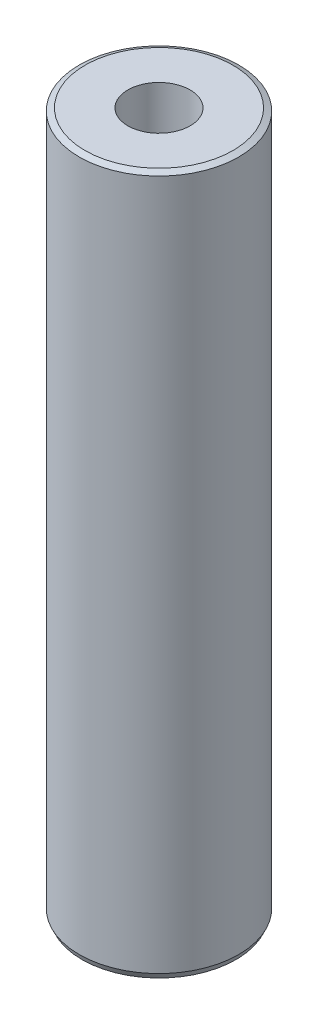
ISO-10303-21;
HEADER;
FILE_DESCRIPTION(('STEP AP214'),'2;1');
FILE_NAME('part.step','',(''),(''),'','','');
FILE_SCHEMA(('AUTOMOTIVE_DESIGN { 1 0 10303 214 1 1 1 1 }'));
ENDSEC;
DATA;
#1=APPLICATION_CONTEXT('core data for automotive mechanical design processes');
#2=APPLICATION_PROTOCOL_DEFINITION('international standard','automotive_design',2000,#1);
#3=PRODUCT_CONTEXT('',#1,'mechanical');
#4=PRODUCT('Part','Part','',(#3));
#5=PRODUCT_RELATED_PRODUCT_CATEGORY('part','',(#4));
#6=PRODUCT_DEFINITION_FORMATION('','',#4);
#7=PRODUCT_DEFINITION_CONTEXT('part definition',#1,'design');
#8=PRODUCT_DEFINITION('design','',#6,#7);
#9=PRODUCT_DEFINITION_SHAPE('','',#8);
#10=(LENGTH_UNIT() NAMED_UNIT(*) SI_UNIT(.MILLI.,.METRE.));
#11=(NAMED_UNIT(*) PLANE_ANGLE_UNIT() SI_UNIT($,.RADIAN.));
#12=(NAMED_UNIT(*) SI_UNIT($,.STERADIAN.) SOLID_ANGLE_UNIT());
#13=UNCERTAINTY_MEASURE_WITH_UNIT(LENGTH_MEASURE(1.E-05),#10,'distance_accuracy_value','');
#14=(GEOMETRIC_REPRESENTATION_CONTEXT(3) GLOBAL_UNCERTAINTY_ASSIGNED_CONTEXT((#13)) GLOBAL_UNIT_ASSIGNED_CONTEXT((#10,
#11,#12)) REPRESENTATION_CONTEXT('',''));
#15=CARTESIAN_POINT('',(0.,0.,0.));
#16=DIRECTION('',(0.,0.,1.));
#17=DIRECTION('',(1.,0.,0.));
#18=AXIS2_PLACEMENT_3D('',#15,#16,#17);
#19=CARTESIAN_POINT('',(0.,87.6766680087707,0.));
#20=DIRECTION('',(0.,-1.,0.));
#21=DIRECTION('',(0.,0.,-1.));
#22=AXIS2_PLACEMENT_3D('',#19,#20,#21);
#23=CYLINDRICAL_SURFACE('',#22,10.);
#24=CARTESIAN_POINT('',(0.,87.3367882755862,0.));
#25=DIRECTION('',(0.,1.,0.));
#26=DIRECTION('',(0.,0.,1.));
#27=AXIS2_PLACEMENT_3D('',#24,#25,#26);
#28=CIRCLE('',#27,10.);
#29=CARTESIAN_POINT('',(0.,87.3367882755862,10.));
#30=VERTEX_POINT('',#29);
#31=EDGE_CURVE('E50',#30,#30,#28,.F.);
#32=ORIENTED_EDGE('',*,*,#31,.T.);
#33=EDGE_LOOP('',(#32));
#34=FACE_BOUND('',#33,.T.);
#35=CARTESIAN_POINT('',(0.,0.723548102302532,0.));
#36=DIRECTION('',(0.,1.,0.));
#37=DIRECTION('',(0.,0.,1.));
#38=AXIS2_PLACEMENT_3D('',#35,#36,#37);
#39=CIRCLE('',#38,10.);
#40=CARTESIAN_POINT('',(0.,0.723548102302532,10.));
#41=VERTEX_POINT('',#40);
#42=EDGE_CURVE('E51',#41,#41,#39,.T.);
#43=ORIENTED_EDGE('',*,*,#42,.T.);
#44=EDGE_LOOP('',(#43));
#45=FACE_BOUND('',#44,.T.);
#46=ADVANCED_FACE('F39',(#34,#45),#23,.T.);
#47=CARTESIAN_POINT('',(0.,87.6766680087707,0.));
#48=DIRECTION('',(0.,1.,0.));
#49=DIRECTION('',(0.,0.,1.));
#50=AXIS2_PLACEMENT_3D('',#47,#48,#49);
#51=PLANE('',#50);
#52=CARTESIAN_POINT('',(0.,87.6766680087707,0.));
#53=DIRECTION('',(0.,1.,0.));
#54=DIRECTION('',(0.,0.,1.));
#55=AXIS2_PLACEMENT_3D('',#52,#53,#54);
#56=CIRCLE('',#55,9.27645189769753);
#57=CARTESIAN_POINT('',(0.,87.6766680087707,9.27645189769753));
#58=VERTEX_POINT('',#57);
#59=EDGE_CURVE('E54',#58,#58,#56,.T.);
#60=ORIENTED_EDGE('',*,*,#59,.T.);
#61=EDGE_LOOP('',(#60));
#62=FACE_BOUND('',#61,.T.);
#63=CARTESIAN_POINT('',(0.,87.6766680087707,0.));
#64=DIRECTION('',(0.,1.,0.));
#65=DIRECTION('',(0.,0.,1.));
#66=AXIS2_PLACEMENT_3D('',#63,#64,#65);
#67=CIRCLE('',#66,3.90674291616439);
#68=CARTESIAN_POINT('',(0.,87.6766680087707,3.90674291616439));
#69=VERTEX_POINT('',#68);
#70=EDGE_CURVE('E58',#69,#69,#67,.T.);
#71=ORIENTED_EDGE('',*,*,#70,.F.);
#72=EDGE_LOOP('',(#71));
#73=FACE_BOUND('',#72,.T.);
#74=ADVANCED_FACE('F69',(#62,#73),#51,.T.);
#75=CARTESIAN_POINT('',(0.,0.,0.));
#76=DIRECTION('',(0.,1.,0.));
#77=DIRECTION('',(0.,0.,1.));
#78=AXIS2_PLACEMENT_3D('',#75,#76,#77);
#79=PLANE('',#78);
#80=CARTESIAN_POINT('',(0.,0.,0.));
#81=DIRECTION('',(0.,1.,0.));
#82=DIRECTION('',(0.,0.,1.));
#83=AXIS2_PLACEMENT_3D('',#80,#81,#82);
#84=CIRCLE('',#83,9.66012026681551);
#85=CARTESIAN_POINT('',(0.,0.,9.66012026681551));
#86=VERTEX_POINT('',#85);
#87=EDGE_CURVE('E10',#86,#86,#84,.F.);
#88=ORIENTED_EDGE('',*,*,#87,.T.);
#89=EDGE_LOOP('',(#88));
#90=FACE_BOUND('',#89,.T.);
#91=CARTESIAN_POINT('',(0.,0.,0.));
#92=DIRECTION('',(0.,1.,0.));
#93=DIRECTION('',(0.,0.,1.));
#94=AXIS2_PLACEMENT_3D('',#91,#92,#93);
#95=CIRCLE('',#94,3.90674291616439);
#96=CARTESIAN_POINT('',(0.,0.,3.90674291616439));
#97=VERTEX_POINT('',#96);
#98=EDGE_CURVE('E63',#97,#97,#95,.T.);
#99=ORIENTED_EDGE('',*,*,#98,.T.);
#100=EDGE_LOOP('',(#99));
#101=FACE_BOUND('',#100,.T.);
#102=ADVANCED_FACE('F75',(#90,#101),#79,.F.);
#103=CARTESIAN_POINT('',(0.,87.6766680087707,0.));
#104=DIRECTION('',(0.,-1.,0.));
#105=DIRECTION('',(0.,0.,-1.));
#106=AXIS2_PLACEMENT_3D('',#103,#104,#105);
#107=CYLINDRICAL_SURFACE('',#106,3.90674291616439);
#108=ORIENTED_EDGE('',*,*,#70,.T.);
#109=EDGE_LOOP('',(#108));
#110=FACE_BOUND('',#109,.T.);
#111=ORIENTED_EDGE('',*,*,#98,.F.);
#112=EDGE_LOOP('',(#111));
#113=FACE_BOUND('',#112,.T.);
#114=ADVANCED_FACE('F70',(#110,#113),#107,.F.);
#115=CARTESIAN_POINT('',(0.,87.6766680087707,0.));
#116=DIRECTION('',(0.,-1.,0.));
#117=DIRECTION('',(0.,0.,-1.));
#118=AXIS2_PLACEMENT_3D('',#115,#116,#117);
#119=CONICAL_SURFACE('',#118,9.27645189769753,1.13164813812509);
#120=ORIENTED_EDGE('',*,*,#31,.F.);
#121=EDGE_LOOP('',(#120));
#122=FACE_BOUND('',#121,.T.);
#123=ORIENTED_EDGE('',*,*,#59,.F.);
#124=EDGE_LOOP('',(#123));
#125=FACE_BOUND('',#124,.T.);
#126=ADVANCED_FACE('F81',(#122,#125),#119,.T.);
#127=CARTESIAN_POINT('',(0.,0.723548102302532,0.));
#128=DIRECTION('',(0.,1.,0.));
#129=DIRECTION('',(0.,0.,1.));
#130=AXIS2_PLACEMENT_3D('',#127,#128,#129);
#131=CONICAL_SURFACE('',#130,10.,0.43914818866979);
#132=ORIENTED_EDGE('',*,*,#87,.F.);
#133=EDGE_LOOP('',(#132));
#134=FACE_BOUND('',#133,.T.);
#135=ORIENTED_EDGE('',*,*,#42,.F.);
#136=EDGE_LOOP('',(#135));
#137=FACE_BOUND('',#136,.T.);
#138=ADVANCED_FACE('F45',(#134,#137),#131,.T.);
#139=CLOSED_SHELL('',(#46,#74,#102,#114,#126,#138));
#140=MANIFOLD_SOLID_BREP('B2',#139);
#141=ADVANCED_BREP_SHAPE_REPRESENTATION('',(#18,#140),#14);
#142=SHAPE_DEFINITION_REPRESENTATION(#9,#141);
ENDSEC;
END-ISO-10303-21;
